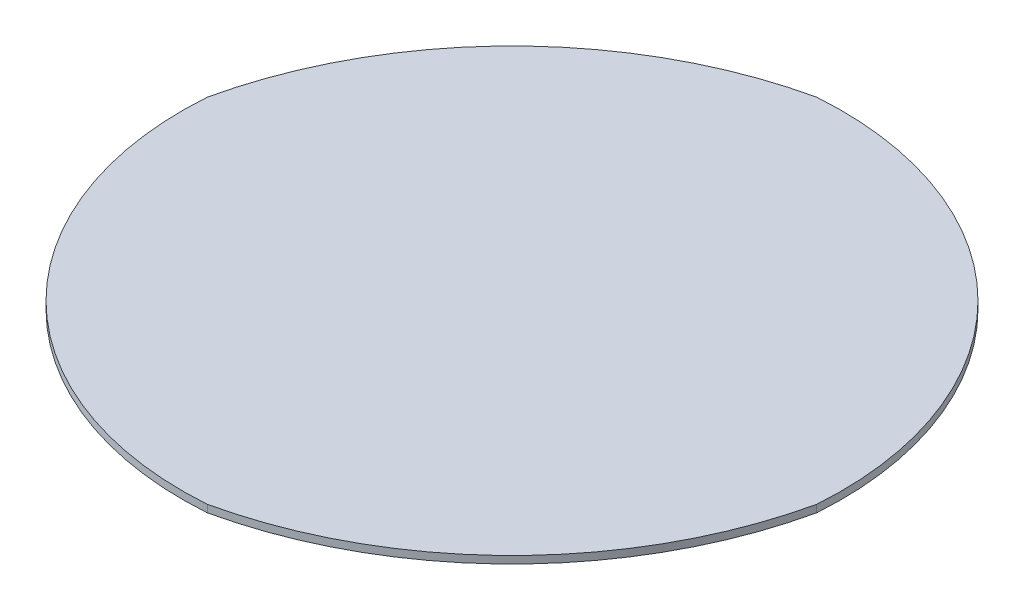
ISO-10303-21;
HEADER;
FILE_DESCRIPTION(('STEP AP214'),'2;1');
FILE_NAME('part.step','',(''),(''),'','','');
FILE_SCHEMA(('AUTOMOTIVE_DESIGN { 1 0 10303 214 1 1 1 1 }'));
ENDSEC;
DATA;
#1=APPLICATION_CONTEXT('core data for automotive mechanical design processes');
#2=APPLICATION_PROTOCOL_DEFINITION('international standard','automotive_design',2000,#1);
#3=PRODUCT_CONTEXT('',#1,'mechanical');
#4=PRODUCT('Part','Part','',(#3));
#5=PRODUCT_RELATED_PRODUCT_CATEGORY('part','',(#4));
#6=PRODUCT_DEFINITION_FORMATION('','',#4);
#7=PRODUCT_DEFINITION_CONTEXT('part definition',#1,'design');
#8=PRODUCT_DEFINITION('design','',#6,#7);
#9=PRODUCT_DEFINITION_SHAPE('','',#8);
#10=(LENGTH_UNIT() NAMED_UNIT(*) SI_UNIT(.MILLI.,.METRE.));
#11=(NAMED_UNIT(*) PLANE_ANGLE_UNIT() SI_UNIT($,.RADIAN.));
#12=(NAMED_UNIT(*) SI_UNIT($,.STERADIAN.) SOLID_ANGLE_UNIT());
#13=UNCERTAINTY_MEASURE_WITH_UNIT(LENGTH_MEASURE(1.E-05),#10,'distance_accuracy_value','');
#14=(GEOMETRIC_REPRESENTATION_CONTEXT(3) GLOBAL_UNCERTAINTY_ASSIGNED_CONTEXT((#13)) GLOBAL_UNIT_ASSIGNED_CONTEXT((#10,
#11,#12)) REPRESENTATION_CONTEXT('',''));
#15=CARTESIAN_POINT('',(0.,0.,0.));
#16=DIRECTION('',(0.,0.,1.));
#17=DIRECTION('',(1.,0.,0.));
#18=AXIS2_PLACEMENT_3D('',#15,#16,#17);
#19=CARTESIAN_POINT('',(0.,2.,0.));
#20=DIRECTION('',(0.,-1.,0.));
#21=DIRECTION('',(0.,0.,-1.));
#22=AXIS2_PLACEMENT_3D('',#19,#20,#21);
#23=CYLINDRICAL_SURFACE('',#22,89.);
#24=CARTESIAN_POINT('',(0.,2.,0.));
#25=DIRECTION('',(0.,1.,0.));
#26=DIRECTION('',(0.,0.,1.));
#27=AXIS2_PLACEMENT_3D('',#24,#25,#26);
#28=CIRCLE('',#27,89.);
#29=CARTESIAN_POINT('',(-88.7639411044549,2.,-6.47786690237342));
#30=VERTEX_POINT('',#29);
#31=CARTESIAN_POINT('',(6.47786690237383,2.,88.7639411044549));
#32=VERTEX_POINT('',#31);
#33=EDGE_CURVE('E91',#30,#32,#28,.T.);
#34=ORIENTED_EDGE('',*,*,#33,.F.);
#35=DIRECTION('',(0.,-1.,0.));
#36=VECTOR('',#35,1.);
#37=CARTESIAN_POINT('',(-88.7639411044549,-10.,-6.47786690237343));
#38=LINE('',#37,#36);
#39=CARTESIAN_POINT('',(-88.7639411044549,0.,-6.47786690237343));
#40=VERTEX_POINT('',#39);
#41=EDGE_CURVE('E99',#30,#40,#38,.T.);
#42=ORIENTED_EDGE('',*,*,#41,.T.);
#43=CARTESIAN_POINT('',(0.,0.,0.));
#44=DIRECTION('',(0.,1.,0.));
#45=DIRECTION('',(0.,0.,1.));
#46=AXIS2_PLACEMENT_3D('',#43,#44,#45);
#47=CIRCLE('',#46,89.);
#48=CARTESIAN_POINT('',(6.47786690237383,0.,88.7639411044549));
#49=VERTEX_POINT('',#48);
#50=EDGE_CURVE('E101',#40,#49,#47,.T.);
#51=ORIENTED_EDGE('',*,*,#50,.T.);
#52=DIRECTION('',(0.,-1.,0.));
#53=VECTOR('',#52,1.);
#54=CARTESIAN_POINT('',(6.47786690237383,-10.,88.7639411044549));
#55=LINE('',#54,#53);
#56=EDGE_CURVE('E59',#32,#49,#55,.T.);
#57=ORIENTED_EDGE('',*,*,#56,.F.);
#58=EDGE_LOOP('',(#34,#42,#51,#57));
#59=FACE_BOUND('',#58,.T.);
#60=ADVANCED_FACE('F38',(#59),#23,.T.);
#61=CARTESIAN_POINT('',(88.7639411044549,0.,6.47786690237324));
#62=VERTEX_POINT('',#61);
#63=CARTESIAN_POINT('',(-6.47786690237343,0.,-88.7639411044549));
#64=VERTEX_POINT('',#63);
#65=EDGE_CURVE('E96',#62,#64,#47,.T.);
#66=ORIENTED_EDGE('',*,*,#65,.T.);
#67=DIRECTION('',(0.,-1.,0.));
#68=VECTOR('',#67,1.);
#69=CARTESIAN_POINT('',(-6.47786690237343,-10.,-88.7639411044549));
#70=LINE('',#69,#68);
#71=CARTESIAN_POINT('',(-6.47786690237342,2.,-88.7639411044549));
#72=VERTEX_POINT('',#71);
#73=EDGE_CURVE('E52',#64,#72,#70,.F.);
#74=ORIENTED_EDGE('',*,*,#73,.T.);
#75=CARTESIAN_POINT('',(88.7639411044549,2.,6.47786690237324));
#76=VERTEX_POINT('',#75);
#77=EDGE_CURVE('E89',#76,#72,#28,.T.);
#78=ORIENTED_EDGE('',*,*,#77,.F.);
#79=DIRECTION('',(0.,-1.,0.));
#80=VECTOR('',#79,1.);
#81=CARTESIAN_POINT('',(88.7639411044549,-10.,6.47786690237324));
#82=LINE('',#81,#80);
#83=EDGE_CURVE('E75',#62,#76,#82,.F.);
#84=ORIENTED_EDGE('',*,*,#83,.F.);
#85=EDGE_LOOP('',(#66,#74,#78,#84));
#86=FACE_BOUND('',#85,.T.);
#87=ADVANCED_FACE('F94',(#86),#23,.T.);
#88=CARTESIAN_POINT('',(0.,2.,0.));
#89=DIRECTION('',(0.,1.,0.));
#90=DIRECTION('',(0.,0.,1.));
#91=AXIS2_PLACEMENT_3D('',#88,#89,#90);
#92=PLANE('',#91);
#93=CARTESIAN_POINT('',(17.0742613776414,2.,17.0742613776414));
#94=DIRECTION('',(0.,1.,0.));
#95=DIRECTION('',(0.,0.,1.));
#96=AXIS2_PLACEMENT_3D('',#93,#94,#95);
#97=CIRCLE('',#96,108.427062356035);
#98=EDGE_CURVE('E92',#72,#30,#97,.T.);
#99=ORIENTED_EDGE('',*,*,#98,.T.);
#100=ORIENTED_EDGE('',*,*,#33,.T.);
#101=CARTESIAN_POINT('',(-17.0742613776415,2.,-17.0742613776413));
#102=DIRECTION('',(0.,1.,0.));
#103=DIRECTION('',(0.,0.,1.));
#104=AXIS2_PLACEMENT_3D('',#101,#102,#103);
#105=CIRCLE('',#104,108.427062356035);
#106=EDGE_CURVE('E78',#76,#32,#105,.F.);
#107=ORIENTED_EDGE('',*,*,#106,.F.);
#108=ORIENTED_EDGE('',*,*,#77,.T.);
#109=EDGE_LOOP('',(#99,#100,#107,#108));
#110=FACE_BOUND('',#109,.T.);
#111=ADVANCED_FACE('F88',(#110),#92,.T.);
#112=CARTESIAN_POINT('',(0.,0.,0.));
#113=DIRECTION('',(0.,1.,0.));
#114=DIRECTION('',(0.,0.,1.));
#115=AXIS2_PLACEMENT_3D('',#112,#113,#114);
#116=PLANE('',#115);
#117=ORIENTED_EDGE('',*,*,#50,.F.);
#118=CARTESIAN_POINT('',(17.0742613776414,0.,17.0742613776414));
#119=DIRECTION('',(0.,1.,0.));
#120=DIRECTION('',(0.,0.,1.));
#121=AXIS2_PLACEMENT_3D('',#118,#119,#120);
#122=CIRCLE('',#121,108.427062356035);
#123=EDGE_CURVE('E11',#40,#64,#122,.F.);
#124=ORIENTED_EDGE('',*,*,#123,.T.);
#125=ORIENTED_EDGE('',*,*,#65,.F.);
#126=CARTESIAN_POINT('',(-17.0742613776415,0.,-17.0742613776413));
#127=DIRECTION('',(0.,1.,0.));
#128=DIRECTION('',(0.,0.,1.));
#129=AXIS2_PLACEMENT_3D('',#126,#127,#128);
#130=CIRCLE('',#129,108.427062356035);
#131=EDGE_CURVE('E45',#49,#62,#130,.T.);
#132=ORIENTED_EDGE('',*,*,#131,.F.);
#133=EDGE_LOOP('',(#117,#124,#125,#132));
#134=FACE_BOUND('',#133,.T.);
#135=ADVANCED_FACE('F115',(#134),#116,.F.);
#136=CARTESIAN_POINT('',(-17.0742613776415,2.,-17.0742613776413));
#137=DIRECTION('',(0.,-1.,0.));
#138=DIRECTION('',(0.,0.,-1.));
#139=AXIS2_PLACEMENT_3D('',#136,#137,#138);
#140=CYLINDRICAL_SURFACE('',#139,108.427062356035);
#141=ORIENTED_EDGE('',*,*,#83,.T.);
#142=ORIENTED_EDGE('',*,*,#106,.T.);
#143=ORIENTED_EDGE('',*,*,#56,.T.);
#144=ORIENTED_EDGE('',*,*,#131,.T.);
#145=EDGE_LOOP('',(#141,#142,#143,#144));
#146=FACE_BOUND('',#145,.T.);
#147=ADVANCED_FACE('F77',(#146),#140,.T.);
#148=CARTESIAN_POINT('',(17.0742613776414,2.,17.0742613776414));
#149=DIRECTION('',(0.,-1.,0.));
#150=DIRECTION('',(0.,0.,-1.));
#151=AXIS2_PLACEMENT_3D('',#148,#149,#150);
#152=CYLINDRICAL_SURFACE('',#151,108.427062356035);
#153=ORIENTED_EDGE('',*,*,#98,.F.);
#154=ORIENTED_EDGE('',*,*,#73,.F.);
#155=ORIENTED_EDGE('',*,*,#123,.F.);
#156=ORIENTED_EDGE('',*,*,#41,.F.);
#157=EDGE_LOOP('',(#153,#154,#155,#156));
#158=FACE_BOUND('',#157,.T.);
#159=ADVANCED_FACE('F124',(#158),#152,.T.);
#160=CLOSED_SHELL('',(#60,#87,#111,#135,#147,#159));
#161=MANIFOLD_SOLID_BREP('B2',#160);
#162=ADVANCED_BREP_SHAPE_REPRESENTATION('',(#18,#161),#14);
#163=SHAPE_DEFINITION_REPRESENTATION(#9,#162);
ENDSEC;
END-ISO-10303-21;
